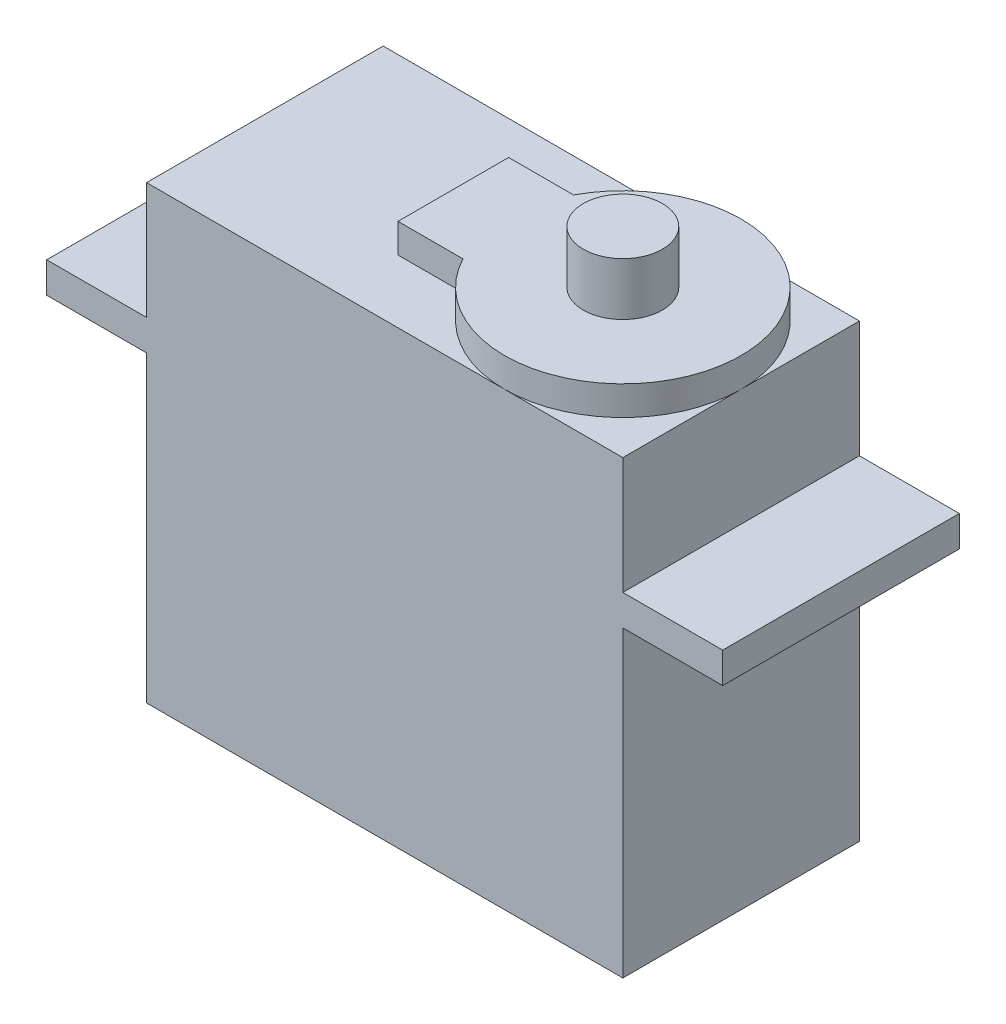
ISO-10303-21;
HEADER;
FILE_DESCRIPTION(('STEP AP214'),'2;1');
FILE_NAME('part.step','',(''),(''),'','','');
FILE_SCHEMA(('AUTOMOTIVE_DESIGN { 1 0 10303 214 1 1 1 1 }'));
ENDSEC;
DATA;
#1=APPLICATION_CONTEXT('core data for automotive mechanical design processes');
#2=APPLICATION_PROTOCOL_DEFINITION('international standard','automotive_design',2000,#1);
#3=PRODUCT_CONTEXT('',#1,'mechanical');
#4=PRODUCT('Part','Part','',(#3));
#5=PRODUCT_RELATED_PRODUCT_CATEGORY('part','',(#4));
#6=PRODUCT_DEFINITION_FORMATION('','',#4);
#7=PRODUCT_DEFINITION_CONTEXT('part definition',#1,'design');
#8=PRODUCT_DEFINITION('design','',#6,#7);
#9=PRODUCT_DEFINITION_SHAPE('','',#8);
#10=(LENGTH_UNIT() NAMED_UNIT(*) SI_UNIT(.MILLI.,.METRE.));
#11=(NAMED_UNIT(*) PLANE_ANGLE_UNIT() SI_UNIT($,.RADIAN.));
#12=(NAMED_UNIT(*) SI_UNIT($,.STERADIAN.) SOLID_ANGLE_UNIT());
#13=UNCERTAINTY_MEASURE_WITH_UNIT(LENGTH_MEASURE(1.E-05),#10,'distance_accuracy_value','');
#14=(GEOMETRIC_REPRESENTATION_CONTEXT(3) GLOBAL_UNCERTAINTY_ASSIGNED_CONTEXT((#13)) GLOBAL_UNIT_ASSIGNED_CONTEXT((#10,
#11,#12)) REPRESENTATION_CONTEXT('',''));
#15=CARTESIAN_POINT('',(0.,0.,0.));
#16=DIRECTION('',(0.,0.,1.));
#17=DIRECTION('',(1.,0.,0.));
#18=AXIS2_PLACEMENT_3D('',#15,#16,#17);
#19=CARTESIAN_POINT('',(-11.811,12.6238,5.8674));
#20=DIRECTION('',(0.,1.,0.));
#21=DIRECTION('',(0.,0.,1.));
#22=AXIS2_PLACEMENT_3D('',#19,#20,#21);
#23=PLANE('',#22);
#24=CARTESIAN_POINT('',(5.9436,12.6238,0.));
#25=DIRECTION('',(0.,1.,0.));
#26=DIRECTION('',(0.,0.,1.));
#27=AXIS2_PLACEMENT_3D('',#24,#25,#26);
#28=CIRCLE('',#27,5.8674);
#29=CARTESIAN_POINT('',(0.756959804266347,12.6238,2.7432));
#30=VERTEX_POINT('',#29);
#31=CARTESIAN_POINT('',(0.756959804266347,12.6238,-2.7432));
#32=VERTEX_POINT('',#31);
#33=EDGE_CURVE('E195',#30,#32,#28,.T.);
#34=ORIENTED_EDGE('',*,*,#33,.T.);
#35=DIRECTION('',(-1.,0.,0.));
#36=VECTOR('',#35,1.);
#37=CARTESIAN_POINT('',(0.756959804266347,12.6238,-2.7432));
#38=LINE('',#37,#36);
#39=CARTESIAN_POINT('',(-2.4638,12.6238,-2.7432));
#40=VERTEX_POINT('',#39);
#41=EDGE_CURVE('E53',#32,#40,#38,.T.);
#42=ORIENTED_EDGE('',*,*,#41,.T.);
#43=DIRECTION('',(0.,0.,1.));
#44=VECTOR('',#43,1.);
#45=CARTESIAN_POINT('',(-2.4638,12.6238,-2.7432));
#46=LINE('',#45,#44);
#47=CARTESIAN_POINT('',(-2.4638,12.6238,2.7432));
#48=VERTEX_POINT('',#47);
#49=EDGE_CURVE('E166',#40,#48,#46,.T.);
#50=ORIENTED_EDGE('',*,*,#49,.T.);
#51=DIRECTION('',(1.,0.,0.));
#52=VECTOR('',#51,1.);
#53=CARTESIAN_POINT('',(0.756959804266347,12.6238,2.7432));
#54=LINE('',#53,#52);
#55=EDGE_CURVE('E174',#48,#30,#54,.T.);
#56=ORIENTED_EDGE('',*,*,#55,.T.);
#57=EDGE_LOOP('',(#34,#42,#50,#56));
#58=FACE_BOUND('',#57,.T.);
#59=CARTESIAN_POINT('',(5.9436,12.6238,0.));
#60=DIRECTION('',(0.,1.,0.));
#61=DIRECTION('',(0.,0.,1.));
#62=AXIS2_PLACEMENT_3D('',#59,#60,#61);
#63=CIRCLE('',#62,1.96215);
#64=CARTESIAN_POINT('',(5.9436,12.6238,1.96215));
#65=VERTEX_POINT('',#64);
#66=EDGE_CURVE('E187',#65,#65,#63,.T.);
#67=ORIENTED_EDGE('',*,*,#66,.F.);
#68=EDGE_LOOP('',(#67));
#69=FACE_BOUND('',#68,.T.);
#70=ADVANCED_FACE('F35',(#58,#69),#23,.T.);
#71=CARTESIAN_POINT('',(-11.811,11.176,5.8674));
#72=DIRECTION('',(0.,-1.,0.));
#73=DIRECTION('',(0.,0.,-1.));
#74=AXIS2_PLACEMENT_3D('',#71,#72,#73);
#75=PLANE('',#74);
#76=CARTESIAN_POINT('',(5.9436,11.176,0.));
#77=DIRECTION('',(0.,1.,0.));
#78=DIRECTION('',(0.,0.,1.));
#79=AXIS2_PLACEMENT_3D('',#76,#77,#78);
#80=CIRCLE('',#79,5.8674);
#81=CARTESIAN_POINT('',(5.9436,11.176,5.8674));
#82=VERTEX_POINT('',#81);
#83=CARTESIAN_POINT('',(11.811,11.176,0.));
#84=VERTEX_POINT('',#83);
#85=EDGE_CURVE('E192',#82,#84,#80,.T.);
#86=ORIENTED_EDGE('',*,*,#85,.F.);
#87=DIRECTION('',(-1.,0.,0.));
#88=VECTOR('',#87,1.);
#89=CARTESIAN_POINT('',(-11.811,11.176,5.8674));
#90=LINE('',#89,#88);
#91=CARTESIAN_POINT('',(11.811,11.176,5.8674));
#92=VERTEX_POINT('',#91);
#93=EDGE_CURVE('E260',#92,#82,#90,.T.);
#94=ORIENTED_EDGE('',*,*,#93,.F.);
#95=DIRECTION('',(0.,0.,-1.));
#96=VECTOR('',#95,1.);
#97=CARTESIAN_POINT('',(11.811,11.176,5.8674));
#98=LINE('',#97,#96);
#99=EDGE_CURVE('E304',#92,#84,#98,.T.);
#100=ORIENTED_EDGE('',*,*,#99,.T.);
#101=EDGE_LOOP('',(#86,#94,#100));
#102=FACE_BOUND('',#101,.T.);
#103=ADVANCED_FACE('F390',(#102),#75,.F.);
#104=CARTESIAN_POINT('',(5.9436,11.176,-5.8674));
#105=VERTEX_POINT('',#104);
#106=EDGE_CURVE('E12',#84,#105,#80,.T.);
#107=ORIENTED_EDGE('',*,*,#106,.F.);
#108=CARTESIAN_POINT('',(11.811,11.176,-5.8674));
#109=VERTEX_POINT('',#108);
#110=EDGE_CURVE('E303',#84,#109,#98,.T.);
#111=ORIENTED_EDGE('',*,*,#110,.T.);
#112=DIRECTION('',(-1.,0.,0.));
#113=VECTOR('',#112,1.);
#114=CARTESIAN_POINT('',(-11.811,11.176,-5.8674));
#115=LINE('',#114,#113);
#116=EDGE_CURVE('E289',#109,#105,#115,.T.);
#117=ORIENTED_EDGE('',*,*,#116,.T.);
#118=EDGE_LOOP('',(#107,#111,#117));
#119=FACE_BOUND('',#118,.T.);
#120=ADVANCED_FACE('F311',(#119),#75,.F.);
#121=DIRECTION('',(0.,0.,1.));
#122=VECTOR('',#121,1.);
#123=CARTESIAN_POINT('',(-2.4638,11.176,-2.7432));
#124=LINE('',#123,#122);
#125=CARTESIAN_POINT('',(-2.4638,11.176,-2.7432));
#126=VERTEX_POINT('',#125);
#127=CARTESIAN_POINT('',(-2.4638,11.176,2.7432));
#128=VERTEX_POINT('',#127);
#129=EDGE_CURVE('E163',#126,#128,#124,.T.);
#130=ORIENTED_EDGE('',*,*,#129,.F.);
#131=DIRECTION('',(-1.,0.,0.));
#132=VECTOR('',#131,1.);
#133=CARTESIAN_POINT('',(0.756959804266347,11.176,-2.7432));
#134=LINE('',#133,#132);
#135=CARTESIAN_POINT('',(0.756959804266347,11.176,-2.7432));
#136=VERTEX_POINT('',#135);
#137=EDGE_CURVE('E167',#136,#126,#134,.T.);
#138=ORIENTED_EDGE('',*,*,#137,.F.);
#139=EDGE_CURVE('E44',#105,#136,#80,.T.);
#140=ORIENTED_EDGE('',*,*,#139,.F.);
#141=CARTESIAN_POINT('',(-11.811,11.176,-5.8674));
#142=VERTEX_POINT('',#141);
#143=EDGE_CURVE('E321',#105,#142,#115,.T.);
#144=ORIENTED_EDGE('',*,*,#143,.T.);
#145=DIRECTION('',(0.,0.,-1.));
#146=VECTOR('',#145,1.);
#147=CARTESIAN_POINT('',(-11.811,11.176,5.8674));
#148=LINE('',#147,#146);
#149=CARTESIAN_POINT('',(-11.811,11.176,5.8674));
#150=VERTEX_POINT('',#149);
#151=EDGE_CURVE('E301',#150,#142,#148,.T.);
#152=ORIENTED_EDGE('',*,*,#151,.F.);
#153=EDGE_CURVE('E257',#82,#150,#90,.T.);
#154=ORIENTED_EDGE('',*,*,#153,.F.);
#155=CARTESIAN_POINT('',(0.756959804266347,11.176,2.7432));
#156=VERTEX_POINT('',#155);
#157=EDGE_CURVE('E46',#156,#82,#80,.T.);
#158=ORIENTED_EDGE('',*,*,#157,.F.);
#159=DIRECTION('',(1.,0.,0.));
#160=VECTOR('',#159,1.);
#161=CARTESIAN_POINT('',(0.756959804266347,11.176,2.7432));
#162=LINE('',#161,#160);
#163=EDGE_CURVE('E178',#128,#156,#162,.T.);
#164=ORIENTED_EDGE('',*,*,#163,.F.);
#165=EDGE_LOOP('',(#130,#138,#140,#144,#152,#154,#158,#164));
#166=FACE_BOUND('',#165,.T.);
#167=ADVANCED_FACE('F176',(#166),#75,.F.);
#168=CARTESIAN_POINT('',(11.811,11.176,5.8674));
#169=DIRECTION('',(-1.,0.,0.));
#170=DIRECTION('',(0.,-1.,0.));
#171=AXIS2_PLACEMENT_3D('',#168,#169,#170);
#172=PLANE('',#171);
#173=DIRECTION('',(0.,0.,1.));
#174=VECTOR('',#173,1.);
#175=CARTESIAN_POINT('',(11.811,5.3848,-11.0495602638282));
#176=LINE('',#175,#174);
#177=CARTESIAN_POINT('',(11.811,5.3848,-5.8674));
#178=VERTEX_POINT('',#177);
#179=CARTESIAN_POINT('',(11.811,5.3848,5.8674));
#180=VERTEX_POINT('',#179);
#181=EDGE_CURVE('E206',#178,#180,#176,.T.);
#182=ORIENTED_EDGE('',*,*,#181,.F.);
#183=DIRECTION('',(0.,1.,0.));
#184=VECTOR('',#183,1.);
#185=CARTESIAN_POINT('',(11.811,11.176,-5.8674));
#186=LINE('',#185,#184);
#187=EDGE_CURVE('E265',#178,#109,#186,.T.);
#188=ORIENTED_EDGE('',*,*,#187,.T.);
#189=ORIENTED_EDGE('',*,*,#110,.F.);
#190=ORIENTED_EDGE('',*,*,#99,.F.);
#191=DIRECTION('',(0.,1.,0.));
#192=VECTOR('',#191,1.);
#193=CARTESIAN_POINT('',(11.811,11.176,5.8674));
#194=LINE('',#193,#192);
#195=EDGE_CURVE('E258',#180,#92,#194,.T.);
#196=ORIENTED_EDGE('',*,*,#195,.F.);
#197=EDGE_LOOP('',(#182,#188,#189,#190,#196));
#198=FACE_BOUND('',#197,.T.);
#199=ADVANCED_FACE('F315',(#198),#172,.F.);
#200=CARTESIAN_POINT('',(-11.811,11.176,5.8674));
#201=DIRECTION('',(1.,0.,0.));
#202=DIRECTION('',(0.,1.,0.));
#203=AXIS2_PLACEMENT_3D('',#200,#201,#202);
#204=PLANE('',#203);
#205=DIRECTION('',(0.,0.,1.));
#206=VECTOR('',#205,1.);
#207=CARTESIAN_POINT('',(-11.811,3.8608,-11.0495602638282));
#208=LINE('',#207,#206);
#209=CARTESIAN_POINT('',(-11.811,3.8608,-5.8674));
#210=VERTEX_POINT('',#209);
#211=CARTESIAN_POINT('',(-11.811,3.8608,5.8674));
#212=VERTEX_POINT('',#211);
#213=EDGE_CURVE('E347',#210,#212,#208,.T.);
#214=ORIENTED_EDGE('',*,*,#213,.F.);
#215=DIRECTION('',(0.,-1.,0.));
#216=VECTOR('',#215,1.);
#217=CARTESIAN_POINT('',(-11.811,11.176,-5.8674));
#218=LINE('',#217,#216);
#219=CARTESIAN_POINT('',(-11.811,-11.176,-5.8674));
#220=VERTEX_POINT('',#219);
#221=EDGE_CURVE('E285',#210,#220,#218,.T.);
#222=ORIENTED_EDGE('',*,*,#221,.T.);
#223=DIRECTION('',(0.,0.,-1.));
#224=VECTOR('',#223,1.);
#225=CARTESIAN_POINT('',(-11.811,-11.176,5.8674));
#226=LINE('',#225,#224);
#227=CARTESIAN_POINT('',(-11.811,-11.176,5.8674));
#228=VERTEX_POINT('',#227);
#229=EDGE_CURVE('E298',#228,#220,#226,.T.);
#230=ORIENTED_EDGE('',*,*,#229,.F.);
#231=DIRECTION('',(0.,-1.,0.));
#232=VECTOR('',#231,1.);
#233=CARTESIAN_POINT('',(-11.811,11.176,5.8674));
#234=LINE('',#233,#232);
#235=EDGE_CURVE('E275',#212,#228,#234,.T.);
#236=ORIENTED_EDGE('',*,*,#235,.F.);
#237=EDGE_LOOP('',(#214,#222,#230,#236));
#238=FACE_BOUND('',#237,.T.);
#239=ADVANCED_FACE('F377',(#238),#204,.F.);
#240=CARTESIAN_POINT('',(11.811,-11.176,-5.8674));
#241=VERTEX_POINT('',#240);
#242=CARTESIAN_POINT('',(11.811,3.8608,-5.8674));
#243=VERTEX_POINT('',#242);
#244=EDGE_CURVE('E244',#241,#243,#186,.T.);
#245=ORIENTED_EDGE('',*,*,#244,.T.);
#246=DIRECTION('',(0.,0.,1.));
#247=VECTOR('',#246,1.);
#248=CARTESIAN_POINT('',(11.811,3.8608,-11.0495602638282));
#249=LINE('',#248,#247);
#250=CARTESIAN_POINT('',(11.811,3.8608,5.8674));
#251=VERTEX_POINT('',#250);
#252=EDGE_CURVE('E212',#243,#251,#249,.T.);
#253=ORIENTED_EDGE('',*,*,#252,.T.);
#254=CARTESIAN_POINT('',(11.811,-11.176,5.8674));
#255=VERTEX_POINT('',#254);
#256=EDGE_CURVE('E252',#255,#251,#194,.T.);
#257=ORIENTED_EDGE('',*,*,#256,.F.);
#258=DIRECTION('',(0.,0.,-1.));
#259=VECTOR('',#258,1.);
#260=CARTESIAN_POINT('',(11.811,-11.176,5.8674));
#261=LINE('',#260,#259);
#262=EDGE_CURVE('E296',#255,#241,#261,.T.);
#263=ORIENTED_EDGE('',*,*,#262,.T.);
#264=EDGE_LOOP('',(#245,#253,#257,#263));
#265=FACE_BOUND('',#264,.T.);
#266=ADVANCED_FACE('F37',(#265),#172,.F.);
#267=CARTESIAN_POINT('',(-11.811,5.3848,-5.8674));
#268=VERTEX_POINT('',#267);
#269=EDGE_CURVE('E288',#142,#268,#218,.T.);
#270=ORIENTED_EDGE('',*,*,#269,.T.);
#271=DIRECTION('',(0.,0.,1.));
#272=VECTOR('',#271,1.);
#273=CARTESIAN_POINT('',(-11.811,5.3848,-11.0495602638282));
#274=LINE('',#273,#272);
#275=CARTESIAN_POINT('',(-11.811,5.3848,5.8674));
#276=VERTEX_POINT('',#275);
#277=EDGE_CURVE('E331',#268,#276,#274,.T.);
#278=ORIENTED_EDGE('',*,*,#277,.T.);
#279=EDGE_CURVE('E282',#150,#276,#234,.T.);
#280=ORIENTED_EDGE('',*,*,#279,.F.);
#281=ORIENTED_EDGE('',*,*,#151,.T.);
#282=EDGE_LOOP('',(#270,#278,#280,#281));
#283=FACE_BOUND('',#282,.T.);
#284=ADVANCED_FACE('F370',(#283),#204,.F.);
#285=CARTESIAN_POINT('',(-11.811,-11.176,5.8674));
#286=DIRECTION('',(0.,1.,0.));
#287=DIRECTION('',(0.,0.,1.));
#288=AXIS2_PLACEMENT_3D('',#285,#286,#287);
#289=PLANE('',#288);
#290=DIRECTION('',(1.,0.,0.));
#291=VECTOR('',#290,1.);
#292=CARTESIAN_POINT('',(-11.811,-11.176,-5.8674));
#293=LINE('',#292,#291);
#294=EDGE_CURVE('E262',#220,#241,#293,.T.);
#295=ORIENTED_EDGE('',*,*,#294,.T.);
#296=ORIENTED_EDGE('',*,*,#262,.F.);
#297=DIRECTION('',(1.,0.,0.));
#298=VECTOR('',#297,1.);
#299=CARTESIAN_POINT('',(-11.811,-11.176,5.8674));
#300=LINE('',#299,#298);
#301=EDGE_CURVE('E255',#228,#255,#300,.T.);
#302=ORIENTED_EDGE('',*,*,#301,.F.);
#303=ORIENTED_EDGE('',*,*,#229,.T.);
#304=EDGE_LOOP('',(#295,#296,#302,#303));
#305=FACE_BOUND('',#304,.T.);
#306=ADVANCED_FACE('F379',(#305),#289,.F.);
#307=CARTESIAN_POINT('',(0.,0.,5.8674));
#308=DIRECTION('',(0.,0.,1.));
#309=DIRECTION('',(1.,0.,0.));
#310=AXIS2_PLACEMENT_3D('',#307,#308,#309);
#311=PLANE('',#310);
#312=ORIENTED_EDGE('',*,*,#256,.T.);
#313=DIRECTION('',(1.,0.,0.));
#314=VECTOR('',#313,1.);
#315=CARTESIAN_POINT('',(11.811,3.8608,5.8674));
#316=LINE('',#315,#314);
#317=CARTESIAN_POINT('',(16.764,3.8608,5.8674));
#318=VERTEX_POINT('',#317);
#319=EDGE_CURVE('E207',#251,#318,#316,.T.);
#320=ORIENTED_EDGE('',*,*,#319,.T.);
#321=DIRECTION('',(0.,1.,0.));
#322=VECTOR('',#321,1.);
#323=CARTESIAN_POINT('',(16.764,5.3848,5.8674));
#324=LINE('',#323,#322);
#325=CARTESIAN_POINT('',(16.764,5.3848,5.8674));
#326=VERTEX_POINT('',#325);
#327=EDGE_CURVE('E203',#318,#326,#324,.T.);
#328=ORIENTED_EDGE('',*,*,#327,.T.);
#329=DIRECTION('',(-1.,0.,0.));
#330=VECTOR('',#329,1.);
#331=CARTESIAN_POINT('',(11.811,5.3848,5.8674));
#332=LINE('',#331,#330);
#333=EDGE_CURVE('E198',#326,#180,#332,.T.);
#334=ORIENTED_EDGE('',*,*,#333,.T.);
#335=ORIENTED_EDGE('',*,*,#195,.T.);
#336=ORIENTED_EDGE('',*,*,#93,.T.);
#337=ORIENTED_EDGE('',*,*,#153,.T.);
#338=ORIENTED_EDGE('',*,*,#279,.T.);
#339=DIRECTION('',(-1.,0.,0.));
#340=VECTOR('',#339,1.);
#341=CARTESIAN_POINT('',(-11.811,5.3848,5.8674));
#342=LINE('',#341,#340);
#343=CARTESIAN_POINT('',(-16.764,5.3848,5.8674));
#344=VERTEX_POINT('',#343);
#345=EDGE_CURVE('E235',#276,#344,#342,.T.);
#346=ORIENTED_EDGE('',*,*,#345,.T.);
#347=DIRECTION('',(0.,-1.,0.));
#348=VECTOR('',#347,1.);
#349=CARTESIAN_POINT('',(-16.764,5.3848,5.8674));
#350=LINE('',#349,#348);
#351=CARTESIAN_POINT('',(-16.764,3.8608,5.8674));
#352=VERTEX_POINT('',#351);
#353=EDGE_CURVE('E330',#344,#352,#350,.T.);
#354=ORIENTED_EDGE('',*,*,#353,.T.);
#355=DIRECTION('',(1.,0.,0.));
#356=VECTOR('',#355,1.);
#357=CARTESIAN_POINT('',(-11.811,3.8608,5.8674));
#358=LINE('',#357,#356);
#359=EDGE_CURVE('E334',#352,#212,#358,.T.);
#360=ORIENTED_EDGE('',*,*,#359,.T.);
#361=ORIENTED_EDGE('',*,*,#235,.T.);
#362=ORIENTED_EDGE('',*,*,#301,.T.);
#363=EDGE_LOOP('',(#312,#320,#328,#334,#335,#336,#337,#338,#346,#354,#360,#361,#362));
#364=FACE_BOUND('',#363,.T.);
#365=ADVANCED_FACE('F253',(#364),#311,.T.);
#366=CARTESIAN_POINT('',(0.,0.,-5.8674));
#367=DIRECTION('',(0.,0.,1.));
#368=DIRECTION('',(1.,0.,0.));
#369=AXIS2_PLACEMENT_3D('',#366,#367,#368);
#370=PLANE('',#369);
#371=ORIENTED_EDGE('',*,*,#244,.F.);
#372=ORIENTED_EDGE('',*,*,#294,.F.);
#373=ORIENTED_EDGE('',*,*,#221,.F.);
#374=DIRECTION('',(-1.,0.,0.));
#375=VECTOR('',#374,1.);
#376=CARTESIAN_POINT('',(-11.811,3.8608,-5.8674));
#377=LINE('',#376,#375);
#378=CARTESIAN_POINT('',(-16.764,3.8608,-5.8674));
#379=VERTEX_POINT('',#378);
#380=EDGE_CURVE('E339',#210,#379,#377,.T.);
#381=ORIENTED_EDGE('',*,*,#380,.T.);
#382=DIRECTION('',(0.,1.,0.));
#383=VECTOR('',#382,1.);
#384=CARTESIAN_POINT('',(-16.764,5.3848,-5.8674));
#385=LINE('',#384,#383);
#386=CARTESIAN_POINT('',(-16.764,5.3848,-5.8674));
#387=VERTEX_POINT('',#386);
#388=EDGE_CURVE('E343',#379,#387,#385,.T.);
#389=ORIENTED_EDGE('',*,*,#388,.T.);
#390=DIRECTION('',(1.,0.,0.));
#391=VECTOR('',#390,1.);
#392=CARTESIAN_POINT('',(-11.811,5.3848,-5.8674));
#393=LINE('',#392,#391);
#394=EDGE_CURVE('E318',#387,#268,#393,.T.);
#395=ORIENTED_EDGE('',*,*,#394,.T.);
#396=ORIENTED_EDGE('',*,*,#269,.F.);
#397=ORIENTED_EDGE('',*,*,#143,.F.);
#398=ORIENTED_EDGE('',*,*,#116,.F.);
#399=ORIENTED_EDGE('',*,*,#187,.F.);
#400=DIRECTION('',(1.,0.,0.));
#401=VECTOR('',#400,1.);
#402=CARTESIAN_POINT('',(11.811,5.3848,-5.8674));
#403=LINE('',#402,#401);
#404=CARTESIAN_POINT('',(16.764,5.3848,-5.8674));
#405=VERTEX_POINT('',#404);
#406=EDGE_CURVE('E201',#178,#405,#403,.T.);
#407=ORIENTED_EDGE('',*,*,#406,.T.);
#408=DIRECTION('',(0.,-1.,0.));
#409=VECTOR('',#408,1.);
#410=CARTESIAN_POINT('',(16.764,5.3848,-5.8674));
#411=LINE('',#410,#409);
#412=CARTESIAN_POINT('',(16.764,3.8608,-5.8674));
#413=VERTEX_POINT('',#412);
#414=EDGE_CURVE('E199',#405,#413,#411,.T.);
#415=ORIENTED_EDGE('',*,*,#414,.T.);
#416=DIRECTION('',(-1.,0.,0.));
#417=VECTOR('',#416,1.);
#418=CARTESIAN_POINT('',(11.811,3.8608,-5.8674));
#419=LINE('',#418,#417);
#420=EDGE_CURVE('E202',#413,#243,#419,.T.);
#421=ORIENTED_EDGE('',*,*,#420,.T.);
#422=EDGE_LOOP('',(#371,#372,#373,#381,#389,#395,#396,#397,#398,#399,#407,#415,#421));
#423=FACE_BOUND('',#422,.T.);
#424=ADVANCED_FACE('F242',(#423),#370,.F.);
#425=CARTESIAN_POINT('',(-11.811,3.8608,-11.0495602638282));
#426=DIRECTION('',(0.,-1.,0.));
#427=DIRECTION('',(1.,0.,0.));
#428=AXIS2_PLACEMENT_3D('',#425,#426,#427);
#429=PLANE('',#428);
#430=ORIENTED_EDGE('',*,*,#380,.F.);
#431=ORIENTED_EDGE('',*,*,#213,.T.);
#432=ORIENTED_EDGE('',*,*,#359,.F.);
#433=DIRECTION('',(0.,0.,1.));
#434=VECTOR('',#433,1.);
#435=CARTESIAN_POINT('',(-16.764,3.8608,-11.0495602638282));
#436=LINE('',#435,#434);
#437=EDGE_CURVE('E350',#379,#352,#436,.T.);
#438=ORIENTED_EDGE('',*,*,#437,.F.);
#439=EDGE_LOOP('',(#430,#431,#432,#438));
#440=FACE_BOUND('',#439,.T.);
#441=ADVANCED_FACE('F374',(#440),#429,.T.);
#442=CARTESIAN_POINT('',(-16.764,5.3848,-11.0495602638282));
#443=DIRECTION('',(-1.,0.,0.));
#444=DIRECTION('',(0.,0.,1.));
#445=AXIS2_PLACEMENT_3D('',#442,#443,#444);
#446=PLANE('',#445);
#447=ORIENTED_EDGE('',*,*,#388,.F.);
#448=ORIENTED_EDGE('',*,*,#437,.T.);
#449=ORIENTED_EDGE('',*,*,#353,.F.);
#450=DIRECTION('',(0.,0.,1.));
#451=VECTOR('',#450,1.);
#452=CARTESIAN_POINT('',(-16.764,5.3848,-11.0495602638282));
#453=LINE('',#452,#451);
#454=EDGE_CURVE('E333',#387,#344,#453,.T.);
#455=ORIENTED_EDGE('',*,*,#454,.F.);
#456=EDGE_LOOP('',(#447,#448,#449,#455));
#457=FACE_BOUND('',#456,.T.);
#458=ADVANCED_FACE('F364',(#457),#446,.T.);
#459=CARTESIAN_POINT('',(-11.811,5.3848,-11.0495602638282));
#460=DIRECTION('',(0.,1.,0.));
#461=DIRECTION('',(0.,0.,1.));
#462=AXIS2_PLACEMENT_3D('',#459,#460,#461);
#463=PLANE('',#462);
#464=ORIENTED_EDGE('',*,*,#394,.F.);
#465=ORIENTED_EDGE('',*,*,#454,.T.);
#466=ORIENTED_EDGE('',*,*,#345,.F.);
#467=ORIENTED_EDGE('',*,*,#277,.F.);
#468=EDGE_LOOP('',(#464,#465,#466,#467));
#469=FACE_BOUND('',#468,.T.);
#470=ADVANCED_FACE('F359',(#469),#463,.T.);
#471=CARTESIAN_POINT('',(11.811,5.3848,-11.0495602638282));
#472=DIRECTION('',(0.,1.,0.));
#473=DIRECTION('',(0.,0.,1.));
#474=AXIS2_PLACEMENT_3D('',#471,#472,#473);
#475=PLANE('',#474);
#476=ORIENTED_EDGE('',*,*,#406,.F.);
#477=ORIENTED_EDGE('',*,*,#181,.T.);
#478=ORIENTED_EDGE('',*,*,#333,.F.);
#479=DIRECTION('',(0.,0.,1.));
#480=VECTOR('',#479,1.);
#481=CARTESIAN_POINT('',(16.764,5.3848,-11.0495602638282));
#482=LINE('',#481,#480);
#483=EDGE_CURVE('E208',#405,#326,#482,.T.);
#484=ORIENTED_EDGE('',*,*,#483,.F.);
#485=EDGE_LOOP('',(#476,#477,#478,#484));
#486=FACE_BOUND('',#485,.T.);
#487=ADVANCED_FACE('F404',(#486),#475,.T.);
#488=CARTESIAN_POINT('',(16.764,5.3848,-11.0495602638282));
#489=DIRECTION('',(1.,0.,0.));
#490=DIRECTION('',(0.,0.,-1.));
#491=AXIS2_PLACEMENT_3D('',#488,#489,#490);
#492=PLANE('',#491);
#493=ORIENTED_EDGE('',*,*,#414,.F.);
#494=ORIENTED_EDGE('',*,*,#483,.T.);
#495=ORIENTED_EDGE('',*,*,#327,.F.);
#496=DIRECTION('',(0.,0.,1.));
#497=VECTOR('',#496,1.);
#498=CARTESIAN_POINT('',(16.764,3.8608,-11.0495602638282));
#499=LINE('',#498,#497);
#500=EDGE_CURVE('E210',#413,#318,#499,.T.);
#501=ORIENTED_EDGE('',*,*,#500,.F.);
#502=EDGE_LOOP('',(#493,#494,#495,#501));
#503=FACE_BOUND('',#502,.T.);
#504=ADVANCED_FACE('F401',(#503),#492,.T.);
#505=CARTESIAN_POINT('',(11.811,3.8608,-11.0495602638282));
#506=DIRECTION('',(0.,-1.,0.));
#507=DIRECTION('',(1.,0.,0.));
#508=AXIS2_PLACEMENT_3D('',#505,#506,#507);
#509=PLANE('',#508);
#510=ORIENTED_EDGE('',*,*,#420,.F.);
#511=ORIENTED_EDGE('',*,*,#500,.T.);
#512=ORIENTED_EDGE('',*,*,#319,.F.);
#513=ORIENTED_EDGE('',*,*,#252,.F.);
#514=EDGE_LOOP('',(#510,#511,#512,#513));
#515=FACE_BOUND('',#514,.T.);
#516=ADVANCED_FACE('F248',(#515),#509,.T.);
#517=CARTESIAN_POINT('',(5.9436,53.0191133117358,0.));
#518=DIRECTION('',(0.,-1.,0.));
#519=DIRECTION('',(0.,0.,-1.));
#520=AXIS2_PLACEMENT_3D('',#517,#518,#519);
#521=CYLINDRICAL_SURFACE('',#520,5.8674);
#522=ORIENTED_EDGE('',*,*,#33,.F.);
#523=DIRECTION('',(0.,1.,0.));
#524=VECTOR('',#523,1.);
#525=CARTESIAN_POINT('',(0.756959804266347,4.81409158531988,2.7432));
#526=LINE('',#525,#524);
#527=EDGE_CURVE('E184',#156,#30,#526,.T.);
#528=ORIENTED_EDGE('',*,*,#527,.F.);
#529=ORIENTED_EDGE('',*,*,#157,.T.);
#530=ORIENTED_EDGE('',*,*,#85,.T.);
#531=ORIENTED_EDGE('',*,*,#106,.T.);
#532=ORIENTED_EDGE('',*,*,#139,.T.);
#533=DIRECTION('',(0.,1.,0.));
#534=VECTOR('',#533,1.);
#535=CARTESIAN_POINT('',(0.756959804266347,4.81409158531988,-2.7432));
#536=LINE('',#535,#534);
#537=EDGE_CURVE('E171',#136,#32,#536,.T.);
#538=ORIENTED_EDGE('',*,*,#537,.T.);
#539=EDGE_LOOP('',(#522,#528,#529,#530,#531,#532,#538));
#540=FACE_BOUND('',#539,.T.);
#541=ADVANCED_FACE('F399',(#540),#521,.T.);
#542=CARTESIAN_POINT('',(5.9436,47.2057982828207,0.));
#543=DIRECTION('',(0.,-1.,0.));
#544=DIRECTION('',(0.,0.,-1.));
#545=AXIS2_PLACEMENT_3D('',#542,#543,#544);
#546=CYLINDRICAL_SURFACE('',#545,1.96215);
#547=ORIENTED_EDGE('',*,*,#66,.T.);
#548=EDGE_LOOP('',(#547));
#549=FACE_BOUND('',#548,.T.);
#550=CARTESIAN_POINT('',(5.9436,15.24,0.));
#551=DIRECTION('',(0.,1.,0.));
#552=DIRECTION('',(0.,0.,1.));
#553=AXIS2_PLACEMENT_3D('',#550,#551,#552);
#554=CIRCLE('',#553,1.96215);
#555=CARTESIAN_POINT('',(5.9436,15.24,1.96215));
#556=VERTEX_POINT('',#555);
#557=EDGE_CURVE('E190',#556,#556,#554,.T.);
#558=ORIENTED_EDGE('',*,*,#557,.F.);
#559=EDGE_LOOP('',(#558));
#560=FACE_BOUND('',#559,.T.);
#561=ADVANCED_FACE('F454',(#549,#560),#546,.T.);
#562=CARTESIAN_POINT('',(-11.811,15.24,5.8674));
#563=DIRECTION('',(0.,1.,0.));
#564=DIRECTION('',(0.,0.,1.));
#565=AXIS2_PLACEMENT_3D('',#562,#563,#564);
#566=PLANE('',#565);
#567=ORIENTED_EDGE('',*,*,#557,.T.);
#568=EDGE_LOOP('',(#567));
#569=FACE_BOUND('',#568,.T.);
#570=ADVANCED_FACE('F462',(#569),#566,.T.);
#571=CARTESIAN_POINT('',(0.756959804266347,4.81409158531988,-2.7432));
#572=DIRECTION('',(0.,0.,-1.));
#573=DIRECTION('',(-1.,0.,0.));
#574=AXIS2_PLACEMENT_3D('',#571,#572,#573);
#575=PLANE('',#574);
#576=ORIENTED_EDGE('',*,*,#537,.F.);
#577=ORIENTED_EDGE('',*,*,#137,.T.);
#578=DIRECTION('',(0.,1.,0.));
#579=VECTOR('',#578,1.);
#580=CARTESIAN_POINT('',(-2.4638,4.81409158531988,-2.7432));
#581=LINE('',#580,#579);
#582=EDGE_CURVE('E159',#126,#40,#581,.T.);
#583=ORIENTED_EDGE('',*,*,#582,.T.);
#584=ORIENTED_EDGE('',*,*,#41,.F.);
#585=EDGE_LOOP('',(#576,#577,#583,#584));
#586=FACE_BOUND('',#585,.T.);
#587=ADVANCED_FACE('F170',(#586),#575,.T.);
#588=CARTESIAN_POINT('',(-2.4638,4.81409158531988,-2.7432));
#589=DIRECTION('',(-1.,0.,0.));
#590=DIRECTION('',(0.,0.,1.));
#591=AXIS2_PLACEMENT_3D('',#588,#589,#590);
#592=PLANE('',#591);
#593=ORIENTED_EDGE('',*,*,#582,.F.);
#594=ORIENTED_EDGE('',*,*,#129,.T.);
#595=DIRECTION('',(0.,1.,0.));
#596=VECTOR('',#595,1.);
#597=CARTESIAN_POINT('',(-2.4638,4.81409158531988,2.7432));
#598=LINE('',#597,#596);
#599=EDGE_CURVE('E179',#128,#48,#598,.T.);
#600=ORIENTED_EDGE('',*,*,#599,.T.);
#601=ORIENTED_EDGE('',*,*,#49,.F.);
#602=EDGE_LOOP('',(#593,#594,#600,#601));
#603=FACE_BOUND('',#602,.T.);
#604=ADVANCED_FACE('F161',(#603),#592,.T.);
#605=CARTESIAN_POINT('',(0.756959804266347,4.81409158531988,2.7432));
#606=DIRECTION('',(0.,0.,1.));
#607=DIRECTION('',(1.,0.,0.));
#608=AXIS2_PLACEMENT_3D('',#605,#606,#607);
#609=PLANE('',#608);
#610=ORIENTED_EDGE('',*,*,#599,.F.);
#611=ORIENTED_EDGE('',*,*,#163,.T.);
#612=ORIENTED_EDGE('',*,*,#527,.T.);
#613=ORIENTED_EDGE('',*,*,#55,.F.);
#614=EDGE_LOOP('',(#610,#611,#612,#613));
#615=FACE_BOUND('',#614,.T.);
#616=ADVANCED_FACE('F481',(#615),#609,.T.);
#617=CLOSED_SHELL('',(#70,#103,#120,#167,#199,#239,#266,#284,#306,#365,#424,#441,#458,#470,#487,
#504,#516,#541,#561,#570,#587,#604,#616));
#618=MANIFOLD_SOLID_BREP('B2',#617);
#619=ADVANCED_BREP_SHAPE_REPRESENTATION('',(#18,#618),#14);
#620=SHAPE_DEFINITION_REPRESENTATION(#9,#619);
ENDSEC;
END-ISO-10303-21;
